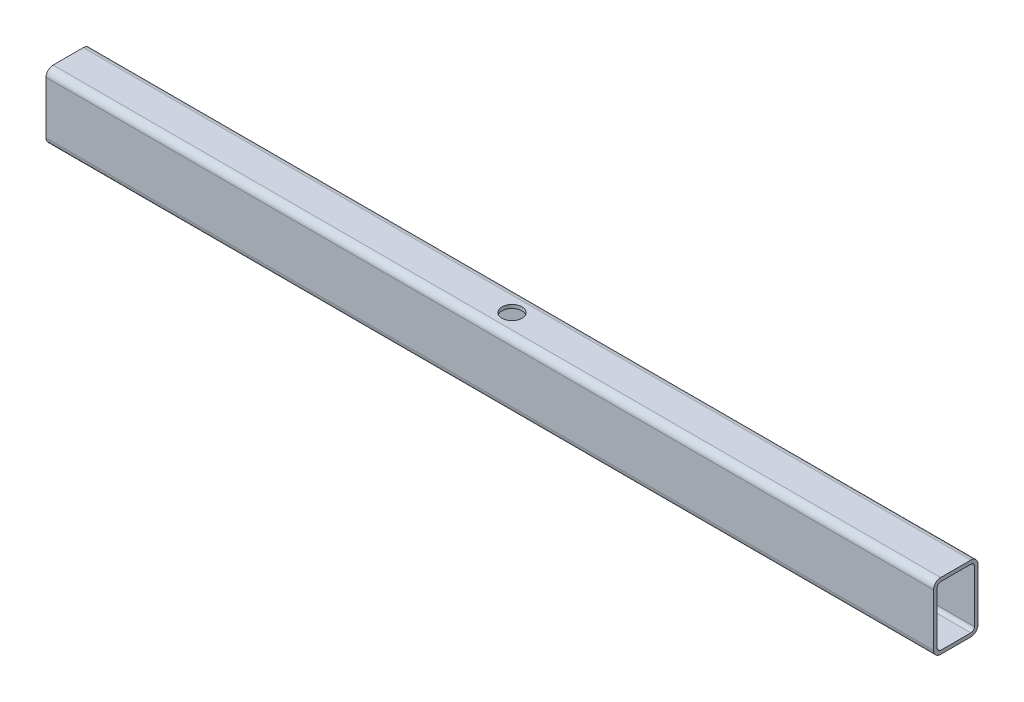
ISO-10303-21;
HEADER;
FILE_DESCRIPTION(('STEP AP214'),'2;1');
FILE_NAME('part.step','',(''),(''),'','','');
FILE_SCHEMA(('AUTOMOTIVE_DESIGN { 1 0 10303 214 1 1 1 1 }'));
ENDSEC;
DATA;
#1=APPLICATION_CONTEXT('core data for automotive mechanical design processes');
#2=APPLICATION_PROTOCOL_DEFINITION('international standard','automotive_design',2000,#1);
#3=PRODUCT_CONTEXT('',#1,'mechanical');
#4=PRODUCT('Part','Part','',(#3));
#5=PRODUCT_RELATED_PRODUCT_CATEGORY('part','',(#4));
#6=PRODUCT_DEFINITION_FORMATION('','',#4);
#7=PRODUCT_DEFINITION_CONTEXT('part definition',#1,'design');
#8=PRODUCT_DEFINITION('design','',#6,#7);
#9=PRODUCT_DEFINITION_SHAPE('','',#8);
#10=(LENGTH_UNIT() NAMED_UNIT(*) SI_UNIT(.MILLI.,.METRE.));
#11=(NAMED_UNIT(*) PLANE_ANGLE_UNIT() SI_UNIT($,.RADIAN.));
#12=(NAMED_UNIT(*) SI_UNIT($,.STERADIAN.) SOLID_ANGLE_UNIT());
#13=UNCERTAINTY_MEASURE_WITH_UNIT(LENGTH_MEASURE(1.E-05),#10,'distance_accuracy_value','');
#14=(GEOMETRIC_REPRESENTATION_CONTEXT(3) GLOBAL_UNCERTAINTY_ASSIGNED_CONTEXT((#13)) GLOBAL_UNIT_ASSIGNED_CONTEXT((#10,
#11,#12)) REPRESENTATION_CONTEXT('',''));
#15=CARTESIAN_POINT('',(0.,0.,0.));
#16=DIRECTION('',(0.,0.,1.));
#17=DIRECTION('',(1.,0.,0.));
#18=AXIS2_PLACEMENT_3D('',#15,#16,#17);
#19=CARTESIAN_POINT('',(200.,5.9,-3.4));
#20=DIRECTION('',(-1.,0.,0.));
#21=DIRECTION('',(0.,0.,1.));
#22=AXIS2_PLACEMENT_3D('',#19,#20,#21);
#23=CYLINDRICAL_SURFACE('',#22,1.6);
#24=CARTESIAN_POINT('',(0.,5.9,-3.4));
#25=DIRECTION('',(1.,0.,0.));
#26=DIRECTION('',(0.,0.,-1.));
#27=AXIS2_PLACEMENT_3D('',#24,#25,#26);
#28=CIRCLE('',#27,1.6);
#29=CARTESIAN_POINT('',(0.,5.9,-5.));
#30=VERTEX_POINT('',#29);
#31=CARTESIAN_POINT('',(0.,7.5,-3.4));
#32=VERTEX_POINT('',#31);
#33=EDGE_CURVE('E238',#30,#32,#28,.T.);
#34=ORIENTED_EDGE('',*,*,#33,.T.);
#35=DIRECTION('',(-1.,0.,0.));
#36=VECTOR('',#35,1.);
#37=CARTESIAN_POINT('',(200.,7.5,-3.4));
#38=LINE('',#37,#36);
#39=CARTESIAN_POINT('',(200.,7.5,-3.4));
#40=VERTEX_POINT('',#39);
#41=EDGE_CURVE('E12',#40,#32,#38,.T.);
#42=ORIENTED_EDGE('',*,*,#41,.F.);
#43=CARTESIAN_POINT('',(200.,5.9,-3.4));
#44=DIRECTION('',(1.,0.,0.));
#45=DIRECTION('',(0.,0.,-1.));
#46=AXIS2_PLACEMENT_3D('',#43,#44,#45);
#47=CIRCLE('',#46,1.6);
#48=CARTESIAN_POINT('',(200.,5.9,-5.));
#49=VERTEX_POINT('',#48);
#50=EDGE_CURVE('E317',#49,#40,#47,.T.);
#51=ORIENTED_EDGE('',*,*,#50,.F.);
#52=DIRECTION('',(-1.,0.,0.));
#53=VECTOR('',#52,1.);
#54=CARTESIAN_POINT('',(200.,5.9,-5.));
#55=LINE('',#54,#53);
#56=EDGE_CURVE('E253',#49,#30,#55,.T.);
#57=ORIENTED_EDGE('',*,*,#56,.T.);
#58=EDGE_LOOP('',(#34,#42,#51,#57));
#59=FACE_BOUND('',#58,.T.);
#60=ADVANCED_FACE('F64',(#59),#23,.T.);
#61=CARTESIAN_POINT('',(200.,7.5,-3.4));
#62=DIRECTION('',(0.,-1.,0.));
#63=DIRECTION('',(0.,0.,-1.));
#64=AXIS2_PLACEMENT_3D('',#61,#62,#63);
#65=PLANE('',#64);
#66=CARTESIAN_POINT('',(100.,7.5,0.));
#67=DIRECTION('',(0.,-1.,0.));
#68=DIRECTION('',(0.,0.,-1.));
#69=AXIS2_PLACEMENT_3D('',#66,#67,#68);
#70=CIRCLE('',#69,2.25);
#71=CARTESIAN_POINT('',(100.,7.5,-2.25));
#72=VERTEX_POINT('',#71);
#73=EDGE_CURVE('E217',#72,#72,#70,.T.);
#74=ORIENTED_EDGE('',*,*,#73,.T.);
#75=EDGE_LOOP('',(#74));
#76=FACE_BOUND('',#75,.T.);
#77=DIRECTION('',(0.,0.,1.));
#78=VECTOR('',#77,1.);
#79=CARTESIAN_POINT('',(0.,7.5,-3.4));
#80=LINE('',#79,#78);
#81=CARTESIAN_POINT('',(0.,7.5,3.4));
#82=VERTEX_POINT('',#81);
#83=EDGE_CURVE('E241',#32,#82,#80,.T.);
#84=ORIENTED_EDGE('',*,*,#83,.T.);
#85=DIRECTION('',(-1.,0.,0.));
#86=VECTOR('',#85,1.);
#87=CARTESIAN_POINT('',(200.,7.5,3.4));
#88=LINE('',#87,#86);
#89=CARTESIAN_POINT('',(200.,7.5,3.4));
#90=VERTEX_POINT('',#89);
#91=EDGE_CURVE('E74',#90,#82,#88,.T.);
#92=ORIENTED_EDGE('',*,*,#91,.F.);
#93=DIRECTION('',(0.,0.,1.));
#94=VECTOR('',#93,1.);
#95=CARTESIAN_POINT('',(200.,7.5,-3.4));
#96=LINE('',#95,#94);
#97=EDGE_CURVE('E319',#40,#90,#96,.T.);
#98=ORIENTED_EDGE('',*,*,#97,.F.);
#99=ORIENTED_EDGE('',*,*,#41,.T.);
#100=EDGE_LOOP('',(#84,#92,#98,#99));
#101=FACE_BOUND('',#100,.T.);
#102=ADVANCED_FACE('F354',(#76,#101),#65,.F.);
#103=CARTESIAN_POINT('',(200.,5.9,3.4));
#104=DIRECTION('',(-1.,0.,0.));
#105=DIRECTION('',(0.,0.,1.));
#106=AXIS2_PLACEMENT_3D('',#103,#104,#105);
#107=CYLINDRICAL_SURFACE('',#106,1.6);
#108=CARTESIAN_POINT('',(0.,5.9,3.4));
#109=DIRECTION('',(1.,0.,0.));
#110=DIRECTION('',(0.,0.,-1.));
#111=AXIS2_PLACEMENT_3D('',#108,#109,#110);
#112=CIRCLE('',#111,1.6);
#113=CARTESIAN_POINT('',(0.,5.9,5.));
#114=VERTEX_POINT('',#113);
#115=EDGE_CURVE('E243',#82,#114,#112,.T.);
#116=ORIENTED_EDGE('',*,*,#115,.T.);
#117=DIRECTION('',(-1.,0.,0.));
#118=VECTOR('',#117,1.);
#119=CARTESIAN_POINT('',(200.,5.9,5.));
#120=LINE('',#119,#118);
#121=CARTESIAN_POINT('',(200.,5.9,5.));
#122=VERTEX_POINT('',#121);
#123=EDGE_CURVE('E260',#122,#114,#120,.T.);
#124=ORIENTED_EDGE('',*,*,#123,.F.);
#125=CARTESIAN_POINT('',(200.,5.9,3.4));
#126=DIRECTION('',(1.,0.,0.));
#127=DIRECTION('',(0.,0.,-1.));
#128=AXIS2_PLACEMENT_3D('',#125,#126,#127);
#129=CIRCLE('',#128,1.6);
#130=EDGE_CURVE('E321',#90,#122,#129,.T.);
#131=ORIENTED_EDGE('',*,*,#130,.F.);
#132=ORIENTED_EDGE('',*,*,#91,.T.);
#133=EDGE_LOOP('',(#116,#124,#131,#132));
#134=FACE_BOUND('',#133,.T.);
#135=ADVANCED_FACE('F359',(#134),#107,.T.);
#136=CARTESIAN_POINT('',(200.,-5.9,5.));
#137=DIRECTION('',(0.,0.,-1.));
#138=DIRECTION('',(-1.,0.,0.));
#139=AXIS2_PLACEMENT_3D('',#136,#137,#138);
#140=PLANE('',#139);
#141=DIRECTION('',(0.,-1.,0.));
#142=VECTOR('',#141,1.);
#143=CARTESIAN_POINT('',(0.,-5.9,5.));
#144=LINE('',#143,#142);
#145=CARTESIAN_POINT('',(0.,-5.9,5.));
#146=VERTEX_POINT('',#145);
#147=EDGE_CURVE('E245',#114,#146,#144,.T.);
#148=ORIENTED_EDGE('',*,*,#147,.T.);
#149=DIRECTION('',(-1.,0.,0.));
#150=VECTOR('',#149,1.);
#151=CARTESIAN_POINT('',(200.,-5.9,5.));
#152=LINE('',#151,#150);
#153=CARTESIAN_POINT('',(200.,-5.9,5.));
#154=VERTEX_POINT('',#153);
#155=EDGE_CURVE('E257',#154,#146,#152,.T.);
#156=ORIENTED_EDGE('',*,*,#155,.F.);
#157=DIRECTION('',(0.,-1.,0.));
#158=VECTOR('',#157,1.);
#159=CARTESIAN_POINT('',(200.,-5.9,5.));
#160=LINE('',#159,#158);
#161=EDGE_CURVE('E323',#122,#154,#160,.T.);
#162=ORIENTED_EDGE('',*,*,#161,.F.);
#163=ORIENTED_EDGE('',*,*,#123,.T.);
#164=EDGE_LOOP('',(#148,#156,#162,#163));
#165=FACE_BOUND('',#164,.T.);
#166=ADVANCED_FACE('F329',(#165),#140,.F.);
#167=CARTESIAN_POINT('',(200.,-5.9,3.4));
#168=DIRECTION('',(-1.,0.,0.));
#169=DIRECTION('',(0.,0.,1.));
#170=AXIS2_PLACEMENT_3D('',#167,#168,#169);
#171=CYLINDRICAL_SURFACE('',#170,1.6);
#172=CARTESIAN_POINT('',(0.,-5.9,3.4));
#173=DIRECTION('',(1.,0.,0.));
#174=DIRECTION('',(0.,0.,-1.));
#175=AXIS2_PLACEMENT_3D('',#172,#173,#174);
#176=CIRCLE('',#175,1.6);
#177=CARTESIAN_POINT('',(0.,-7.5,3.4));
#178=VERTEX_POINT('',#177);
#179=EDGE_CURVE('E247',#146,#178,#176,.T.);
#180=ORIENTED_EDGE('',*,*,#179,.T.);
#181=DIRECTION('',(-1.,0.,0.));
#182=VECTOR('',#181,1.);
#183=CARTESIAN_POINT('',(200.,-7.5,3.4));
#184=LINE('',#183,#182);
#185=CARTESIAN_POINT('',(200.,-7.5,3.4));
#186=VERTEX_POINT('',#185);
#187=EDGE_CURVE('E204',#186,#178,#184,.T.);
#188=ORIENTED_EDGE('',*,*,#187,.F.);
#189=CARTESIAN_POINT('',(200.,-5.9,3.4));
#190=DIRECTION('',(1.,0.,0.));
#191=DIRECTION('',(0.,0.,-1.));
#192=AXIS2_PLACEMENT_3D('',#189,#190,#191);
#193=CIRCLE('',#192,1.6);
#194=EDGE_CURVE('E195',#154,#186,#193,.T.);
#195=ORIENTED_EDGE('',*,*,#194,.F.);
#196=ORIENTED_EDGE('',*,*,#155,.T.);
#197=EDGE_LOOP('',(#180,#188,#195,#196));
#198=FACE_BOUND('',#197,.T.);
#199=ADVANCED_FACE('F333',(#198),#171,.T.);
#200=CARTESIAN_POINT('',(200.,-7.5,3.4));
#201=DIRECTION('',(0.,1.,0.));
#202=DIRECTION('',(0.,0.,1.));
#203=AXIS2_PLACEMENT_3D('',#200,#201,#202);
#204=PLANE('',#203);
#205=CARTESIAN_POINT('',(100.,-7.5,0.));
#206=DIRECTION('',(0.,1.,0.));
#207=DIRECTION('',(0.,0.,1.));
#208=AXIS2_PLACEMENT_3D('',#205,#206,#207);
#209=CIRCLE('',#208,2.25);
#210=CARTESIAN_POINT('',(100.,-7.5,2.24999999999999));
#211=VERTEX_POINT('',#210);
#212=EDGE_CURVE('E389',#211,#211,#209,.T.);
#213=ORIENTED_EDGE('',*,*,#212,.T.);
#214=EDGE_LOOP('',(#213));
#215=FACE_BOUND('',#214,.T.);
#216=DIRECTION('',(0.,0.,-1.));
#217=VECTOR('',#216,1.);
#218=CARTESIAN_POINT('',(0.,-7.5,3.4));
#219=LINE('',#218,#217);
#220=CARTESIAN_POINT('',(0.,-7.5,-3.4));
#221=VERTEX_POINT('',#220);
#222=EDGE_CURVE('E203',#178,#221,#219,.T.);
#223=ORIENTED_EDGE('',*,*,#222,.T.);
#224=DIRECTION('',(-1.,0.,0.));
#225=VECTOR('',#224,1.);
#226=CARTESIAN_POINT('',(200.,-7.5,-3.4));
#227=LINE('',#226,#225);
#228=CARTESIAN_POINT('',(200.,-7.5,-3.4));
#229=VERTEX_POINT('',#228);
#230=EDGE_CURVE('E200',#229,#221,#227,.T.);
#231=ORIENTED_EDGE('',*,*,#230,.F.);
#232=DIRECTION('',(0.,0.,-1.));
#233=VECTOR('',#232,1.);
#234=CARTESIAN_POINT('',(200.,-7.5,3.4));
#235=LINE('',#234,#233);
#236=EDGE_CURVE('E189',#186,#229,#235,.T.);
#237=ORIENTED_EDGE('',*,*,#236,.F.);
#238=ORIENTED_EDGE('',*,*,#187,.T.);
#239=EDGE_LOOP('',(#223,#231,#237,#238));
#240=FACE_BOUND('',#239,.T.);
#241=ADVANCED_FACE('F201',(#215,#240),#204,.F.);
#242=CARTESIAN_POINT('',(200.,-5.9,-3.4));
#243=DIRECTION('',(-1.,0.,0.));
#244=DIRECTION('',(0.,0.,1.));
#245=AXIS2_PLACEMENT_3D('',#242,#243,#244);
#246=CYLINDRICAL_SURFACE('',#245,1.6);
#247=CARTESIAN_POINT('',(0.,-5.9,-3.4));
#248=DIRECTION('',(1.,0.,0.));
#249=DIRECTION('',(0.,0.,-1.));
#250=AXIS2_PLACEMENT_3D('',#247,#248,#249);
#251=CIRCLE('',#250,1.6);
#252=CARTESIAN_POINT('',(0.,-5.9,-5.));
#253=VERTEX_POINT('',#252);
#254=EDGE_CURVE('E136',#221,#253,#251,.T.);
#255=ORIENTED_EDGE('',*,*,#254,.T.);
#256=DIRECTION('',(-1.,0.,0.));
#257=VECTOR('',#256,1.);
#258=CARTESIAN_POINT('',(200.,-5.9,-5.));
#259=LINE('',#258,#257);
#260=CARTESIAN_POINT('',(200.,-5.9,-5.));
#261=VERTEX_POINT('',#260);
#262=EDGE_CURVE('E205',#261,#253,#259,.T.);
#263=ORIENTED_EDGE('',*,*,#262,.F.);
#264=CARTESIAN_POINT('',(200.,-5.9,-3.4));
#265=DIRECTION('',(1.,0.,0.));
#266=DIRECTION('',(0.,0.,-1.));
#267=AXIS2_PLACEMENT_3D('',#264,#265,#266);
#268=CIRCLE('',#267,1.6);
#269=EDGE_CURVE('E193',#229,#261,#268,.T.);
#270=ORIENTED_EDGE('',*,*,#269,.F.);
#271=ORIENTED_EDGE('',*,*,#230,.T.);
#272=EDGE_LOOP('',(#255,#263,#270,#271));
#273=FACE_BOUND('',#272,.T.);
#274=ADVANCED_FACE('F207',(#273),#246,.T.);
#275=CARTESIAN_POINT('',(200.,5.9,3.4));
#276=DIRECTION('',(-1.,0.,0.));
#277=DIRECTION('',(0.,0.,1.));
#278=AXIS2_PLACEMENT_3D('',#275,#276,#277);
#279=CYLINDRICAL_SURFACE('',#278,0.8);
#280=CARTESIAN_POINT('',(0.,5.9,3.4));
#281=DIRECTION('',(1.,0.,0.));
#282=DIRECTION('',(0.,0.,-1.));
#283=AXIS2_PLACEMENT_3D('',#280,#281,#282);
#284=CIRCLE('',#283,0.8);
#285=CARTESIAN_POINT('',(0.,6.7,3.4));
#286=VERTEX_POINT('',#285);
#287=CARTESIAN_POINT('',(0.,5.9,4.2));
#288=VERTEX_POINT('',#287);
#289=EDGE_CURVE('E213',#286,#288,#284,.T.);
#290=ORIENTED_EDGE('',*,*,#289,.F.);
#291=DIRECTION('',(-1.,0.,0.));
#292=VECTOR('',#291,1.);
#293=CARTESIAN_POINT('',(200.,6.7,3.4));
#294=LINE('',#293,#292);
#295=CARTESIAN_POINT('',(200.,6.7,3.4));
#296=VERTEX_POINT('',#295);
#297=EDGE_CURVE('E150',#296,#286,#294,.T.);
#298=ORIENTED_EDGE('',*,*,#297,.F.);
#299=CARTESIAN_POINT('',(200.,5.9,3.4));
#300=DIRECTION('',(1.,0.,0.));
#301=DIRECTION('',(0.,0.,-1.));
#302=AXIS2_PLACEMENT_3D('',#299,#300,#301);
#303=CIRCLE('',#302,0.8);
#304=CARTESIAN_POINT('',(200.,5.9,4.2));
#305=VERTEX_POINT('',#304);
#306=EDGE_CURVE('E252',#296,#305,#303,.T.);
#307=ORIENTED_EDGE('',*,*,#306,.T.);
#308=DIRECTION('',(-1.,0.,0.));
#309=VECTOR('',#308,1.);
#310=CARTESIAN_POINT('',(200.,5.9,4.2));
#311=LINE('',#310,#309);
#312=EDGE_CURVE('E209',#305,#288,#311,.T.);
#313=ORIENTED_EDGE('',*,*,#312,.T.);
#314=EDGE_LOOP('',(#290,#298,#307,#313));
#315=FACE_BOUND('',#314,.T.);
#316=ADVANCED_FACE('F66',(#315),#279,.F.);
#317=CARTESIAN_POINT('',(200.,6.7,-3.4));
#318=DIRECTION('',(0.,-1.,0.));
#319=DIRECTION('',(0.,0.,-1.));
#320=AXIS2_PLACEMENT_3D('',#317,#318,#319);
#321=PLANE('',#320);
#322=CARTESIAN_POINT('',(100.,6.7,0.));
#323=DIRECTION('',(0.,-1.,0.));
#324=DIRECTION('',(0.,0.,-1.));
#325=AXIS2_PLACEMENT_3D('',#322,#323,#324);
#326=CIRCLE('',#325,2.25);
#327=CARTESIAN_POINT('',(100.,6.7,-2.25));
#328=VERTEX_POINT('',#327);
#329=EDGE_CURVE('E387',#328,#328,#326,.T.);
#330=ORIENTED_EDGE('',*,*,#329,.F.);
#331=EDGE_LOOP('',(#330));
#332=FACE_BOUND('',#331,.T.);
#333=DIRECTION('',(0.,0.,1.));
#334=VECTOR('',#333,1.);
#335=CARTESIAN_POINT('',(0.,6.7,-3.4));
#336=LINE('',#335,#334);
#337=CARTESIAN_POINT('',(0.,6.7,-3.4));
#338=VERTEX_POINT('',#337);
#339=EDGE_CURVE('E216',#338,#286,#336,.T.);
#340=ORIENTED_EDGE('',*,*,#339,.F.);
#341=DIRECTION('',(-1.,0.,0.));
#342=VECTOR('',#341,1.);
#343=CARTESIAN_POINT('',(200.,6.7,-3.4));
#344=LINE('',#343,#342);
#345=CARTESIAN_POINT('',(200.,6.7,-3.4));
#346=VERTEX_POINT('',#345);
#347=EDGE_CURVE('E276',#346,#338,#344,.T.);
#348=ORIENTED_EDGE('',*,*,#347,.F.);
#349=DIRECTION('',(0.,0.,1.));
#350=VECTOR('',#349,1.);
#351=CARTESIAN_POINT('',(200.,6.7,-3.4));
#352=LINE('',#351,#350);
#353=EDGE_CURVE('E282',#346,#296,#352,.T.);
#354=ORIENTED_EDGE('',*,*,#353,.T.);
#355=ORIENTED_EDGE('',*,*,#297,.T.);
#356=EDGE_LOOP('',(#340,#348,#354,#355));
#357=FACE_BOUND('',#356,.T.);
#358=ADVANCED_FACE('F280',(#332,#357),#321,.T.);
#359=CARTESIAN_POINT('',(200.,5.9,-3.4));
#360=DIRECTION('',(-1.,0.,0.));
#361=DIRECTION('',(0.,0.,1.));
#362=AXIS2_PLACEMENT_3D('',#359,#360,#361);
#363=CYLINDRICAL_SURFACE('',#362,0.8);
#364=CARTESIAN_POINT('',(0.,5.9,-3.4));
#365=DIRECTION('',(1.,0.,0.));
#366=DIRECTION('',(0.,0.,-1.));
#367=AXIS2_PLACEMENT_3D('',#364,#365,#366);
#368=CIRCLE('',#367,0.8);
#369=CARTESIAN_POINT('',(0.,5.9,-4.2));
#370=VERTEX_POINT('',#369);
#371=EDGE_CURVE('E220',#370,#338,#368,.T.);
#372=ORIENTED_EDGE('',*,*,#371,.F.);
#373=DIRECTION('',(-1.,0.,0.));
#374=VECTOR('',#373,1.);
#375=CARTESIAN_POINT('',(200.,5.9,-4.2));
#376=LINE('',#375,#374);
#377=CARTESIAN_POINT('',(200.,5.9,-4.2));
#378=VERTEX_POINT('',#377);
#379=EDGE_CURVE('E274',#378,#370,#376,.T.);
#380=ORIENTED_EDGE('',*,*,#379,.F.);
#381=CARTESIAN_POINT('',(200.,5.9,-3.4));
#382=DIRECTION('',(1.,0.,0.));
#383=DIRECTION('',(0.,0.,-1.));
#384=AXIS2_PLACEMENT_3D('',#381,#382,#383);
#385=CIRCLE('',#384,0.8);
#386=EDGE_CURVE('E293',#378,#346,#385,.T.);
#387=ORIENTED_EDGE('',*,*,#386,.T.);
#388=ORIENTED_EDGE('',*,*,#347,.T.);
#389=EDGE_LOOP('',(#372,#380,#387,#388));
#390=FACE_BOUND('',#389,.T.);
#391=ADVANCED_FACE('F290',(#390),#363,.F.);
#392=CARTESIAN_POINT('',(200.,5.9,-4.2));
#393=DIRECTION('',(0.,0.,1.));
#394=DIRECTION('',(1.,0.,0.));
#395=AXIS2_PLACEMENT_3D('',#392,#393,#394);
#396=PLANE('',#395);
#397=DIRECTION('',(0.,1.,0.));
#398=VECTOR('',#397,1.);
#399=CARTESIAN_POINT('',(0.,5.9,-4.2));
#400=LINE('',#399,#398);
#401=CARTESIAN_POINT('',(0.,-5.9,-4.2));
#402=VERTEX_POINT('',#401);
#403=EDGE_CURVE('E223',#402,#370,#400,.T.);
#404=ORIENTED_EDGE('',*,*,#403,.F.);
#405=DIRECTION('',(-1.,0.,0.));
#406=VECTOR('',#405,1.);
#407=CARTESIAN_POINT('',(200.,-5.9,-4.2));
#408=LINE('',#407,#406);
#409=CARTESIAN_POINT('',(200.,-5.9,-4.2));
#410=VERTEX_POINT('',#409);
#411=EDGE_CURVE('E272',#410,#402,#408,.T.);
#412=ORIENTED_EDGE('',*,*,#411,.F.);
#413=DIRECTION('',(0.,1.,0.));
#414=VECTOR('',#413,1.);
#415=CARTESIAN_POINT('',(200.,5.9,-4.2));
#416=LINE('',#415,#414);
#417=EDGE_CURVE('E299',#410,#378,#416,.T.);
#418=ORIENTED_EDGE('',*,*,#417,.T.);
#419=ORIENTED_EDGE('',*,*,#379,.T.);
#420=EDGE_LOOP('',(#404,#412,#418,#419));
#421=FACE_BOUND('',#420,.T.);
#422=ADVANCED_FACE('F374',(#421),#396,.T.);
#423=CARTESIAN_POINT('',(200.,-5.9,-3.4));
#424=DIRECTION('',(-1.,0.,0.));
#425=DIRECTION('',(0.,0.,1.));
#426=AXIS2_PLACEMENT_3D('',#423,#424,#425);
#427=CYLINDRICAL_SURFACE('',#426,0.8);
#428=CARTESIAN_POINT('',(0.,-5.9,-3.4));
#429=DIRECTION('',(1.,0.,0.));
#430=DIRECTION('',(0.,0.,-1.));
#431=AXIS2_PLACEMENT_3D('',#428,#429,#430);
#432=CIRCLE('',#431,0.8);
#433=CARTESIAN_POINT('',(0.,-6.7,-3.4));
#434=VERTEX_POINT('',#433);
#435=EDGE_CURVE('E226',#434,#402,#432,.T.);
#436=ORIENTED_EDGE('',*,*,#435,.F.);
#437=DIRECTION('',(-1.,0.,0.));
#438=VECTOR('',#437,1.);
#439=CARTESIAN_POINT('',(200.,-6.7,-3.4));
#440=LINE('',#439,#438);
#441=CARTESIAN_POINT('',(200.,-6.7,-3.4));
#442=VERTEX_POINT('',#441);
#443=EDGE_CURVE('E270',#442,#434,#440,.T.);
#444=ORIENTED_EDGE('',*,*,#443,.F.);
#445=CARTESIAN_POINT('',(200.,-5.9,-3.4));
#446=DIRECTION('',(1.,0.,0.));
#447=DIRECTION('',(0.,0.,-1.));
#448=AXIS2_PLACEMENT_3D('',#445,#446,#447);
#449=CIRCLE('',#448,0.8);
#450=EDGE_CURVE('E305',#442,#410,#449,.T.);
#451=ORIENTED_EDGE('',*,*,#450,.T.);
#452=ORIENTED_EDGE('',*,*,#411,.T.);
#453=EDGE_LOOP('',(#436,#444,#451,#452));
#454=FACE_BOUND('',#453,.T.);
#455=ADVANCED_FACE('F370',(#454),#427,.F.);
#456=CARTESIAN_POINT('',(200.,-6.7,3.4));
#457=DIRECTION('',(0.,1.,0.));
#458=DIRECTION('',(0.,0.,1.));
#459=AXIS2_PLACEMENT_3D('',#456,#457,#458);
#460=PLANE('',#459);
#461=CARTESIAN_POINT('',(100.,-6.7,0.));
#462=DIRECTION('',(0.,1.,0.));
#463=DIRECTION('',(0.,0.,1.));
#464=AXIS2_PLACEMENT_3D('',#461,#462,#463);
#465=CIRCLE('',#464,2.25);
#466=CARTESIAN_POINT('',(100.,-6.7,2.24999999999999));
#467=VERTEX_POINT('',#466);
#468=EDGE_CURVE('E68',#467,#467,#465,.T.);
#469=ORIENTED_EDGE('',*,*,#468,.F.);
#470=EDGE_LOOP('',(#469));
#471=FACE_BOUND('',#470,.T.);
#472=DIRECTION('',(0.,0.,-1.));
#473=VECTOR('',#472,1.);
#474=CARTESIAN_POINT('',(0.,-6.7,3.4));
#475=LINE('',#474,#473);
#476=CARTESIAN_POINT('',(0.,-6.7,3.4));
#477=VERTEX_POINT('',#476);
#478=EDGE_CURVE('E229',#477,#434,#475,.T.);
#479=ORIENTED_EDGE('',*,*,#478,.F.);
#480=DIRECTION('',(-1.,0.,0.));
#481=VECTOR('',#480,1.);
#482=CARTESIAN_POINT('',(200.,-6.7,3.4));
#483=LINE('',#482,#481);
#484=CARTESIAN_POINT('',(200.,-6.7,3.4));
#485=VERTEX_POINT('',#484);
#486=EDGE_CURVE('E268',#485,#477,#483,.T.);
#487=ORIENTED_EDGE('',*,*,#486,.F.);
#488=DIRECTION('',(0.,0.,-1.));
#489=VECTOR('',#488,1.);
#490=CARTESIAN_POINT('',(200.,-6.7,3.4));
#491=LINE('',#490,#489);
#492=EDGE_CURVE('E308',#485,#442,#491,.T.);
#493=ORIENTED_EDGE('',*,*,#492,.T.);
#494=ORIENTED_EDGE('',*,*,#443,.T.);
#495=EDGE_LOOP('',(#479,#487,#493,#494));
#496=FACE_BOUND('',#495,.T.);
#497=ADVANCED_FACE('F366',(#471,#496),#460,.T.);
#498=CARTESIAN_POINT('',(200.,-5.9,3.4));
#499=DIRECTION('',(-1.,0.,0.));
#500=DIRECTION('',(0.,0.,1.));
#501=AXIS2_PLACEMENT_3D('',#498,#499,#500);
#502=CYLINDRICAL_SURFACE('',#501,0.8);
#503=CARTESIAN_POINT('',(0.,-5.9,3.4));
#504=DIRECTION('',(1.,0.,0.));
#505=DIRECTION('',(0.,0.,-1.));
#506=AXIS2_PLACEMENT_3D('',#503,#504,#505);
#507=CIRCLE('',#506,0.8);
#508=CARTESIAN_POINT('',(0.,-5.9,4.2));
#509=VERTEX_POINT('',#508);
#510=EDGE_CURVE('E232',#509,#477,#507,.T.);
#511=ORIENTED_EDGE('',*,*,#510,.F.);
#512=DIRECTION('',(-1.,0.,0.));
#513=VECTOR('',#512,1.);
#514=CARTESIAN_POINT('',(200.,-5.9,4.2));
#515=LINE('',#514,#513);
#516=CARTESIAN_POINT('',(200.,-5.9,4.2));
#517=VERTEX_POINT('',#516);
#518=EDGE_CURVE('E266',#517,#509,#515,.T.);
#519=ORIENTED_EDGE('',*,*,#518,.F.);
#520=CARTESIAN_POINT('',(200.,-5.9,3.4));
#521=DIRECTION('',(1.,0.,0.));
#522=DIRECTION('',(0.,0.,-1.));
#523=AXIS2_PLACEMENT_3D('',#520,#521,#522);
#524=CIRCLE('',#523,0.8);
#525=EDGE_CURVE('E311',#517,#485,#524,.T.);
#526=ORIENTED_EDGE('',*,*,#525,.T.);
#527=ORIENTED_EDGE('',*,*,#486,.T.);
#528=EDGE_LOOP('',(#511,#519,#526,#527));
#529=FACE_BOUND('',#528,.T.);
#530=ADVANCED_FACE('F348',(#529),#502,.F.);
#531=CARTESIAN_POINT('',(200.,-5.9,4.2));
#532=DIRECTION('',(0.,0.,-1.));
#533=DIRECTION('',(-1.,0.,0.));
#534=AXIS2_PLACEMENT_3D('',#531,#532,#533);
#535=PLANE('',#534);
#536=DIRECTION('',(0.,-1.,0.));
#537=VECTOR('',#536,1.);
#538=CARTESIAN_POINT('',(0.,-5.9,4.2));
#539=LINE('',#538,#537);
#540=EDGE_CURVE('E235',#288,#509,#539,.T.);
#541=ORIENTED_EDGE('',*,*,#540,.F.);
#542=ORIENTED_EDGE('',*,*,#312,.F.);
#543=DIRECTION('',(0.,-1.,0.));
#544=VECTOR('',#543,1.);
#545=CARTESIAN_POINT('',(200.,-5.9,4.2));
#546=LINE('',#545,#544);
#547=EDGE_CURVE('E314',#305,#517,#546,.T.);
#548=ORIENTED_EDGE('',*,*,#547,.T.);
#549=ORIENTED_EDGE('',*,*,#518,.T.);
#550=EDGE_LOOP('',(#541,#542,#548,#549));
#551=FACE_BOUND('',#550,.T.);
#552=ADVANCED_FACE('F341',(#551),#535,.T.);
#553=CARTESIAN_POINT('',(200.,5.9,-5.));
#554=DIRECTION('',(0.,0.,1.));
#555=DIRECTION('',(1.,0.,0.));
#556=AXIS2_PLACEMENT_3D('',#553,#554,#555);
#557=PLANE('',#556);
#558=DIRECTION('',(0.,1.,0.));
#559=VECTOR('',#558,1.);
#560=CARTESIAN_POINT('',(0.,5.9,-5.));
#561=LINE('',#560,#559);
#562=EDGE_CURVE('E142',#253,#30,#561,.T.);
#563=ORIENTED_EDGE('',*,*,#562,.T.);
#564=ORIENTED_EDGE('',*,*,#56,.F.);
#565=DIRECTION('',(0.,1.,0.));
#566=VECTOR('',#565,1.);
#567=CARTESIAN_POINT('',(200.,5.9,-5.));
#568=LINE('',#567,#566);
#569=EDGE_CURVE('E83',#261,#49,#568,.T.);
#570=ORIENTED_EDGE('',*,*,#569,.F.);
#571=ORIENTED_EDGE('',*,*,#262,.T.);
#572=EDGE_LOOP('',(#563,#564,#570,#571));
#573=FACE_BOUND('',#572,.T.);
#574=ADVANCED_FACE('F339',(#573),#557,.F.);
#575=CARTESIAN_POINT('',(200.,5.9,-3.4));
#576=DIRECTION('',(1.,0.,0.));
#577=DIRECTION('',(0.,0.,-1.));
#578=AXIS2_PLACEMENT_3D('',#575,#576,#577);
#579=PLANE('',#578);
#580=ORIENTED_EDGE('',*,*,#306,.F.);
#581=ORIENTED_EDGE('',*,*,#353,.F.);
#582=ORIENTED_EDGE('',*,*,#386,.F.);
#583=ORIENTED_EDGE('',*,*,#417,.F.);
#584=ORIENTED_EDGE('',*,*,#450,.F.);
#585=ORIENTED_EDGE('',*,*,#492,.F.);
#586=ORIENTED_EDGE('',*,*,#525,.F.);
#587=ORIENTED_EDGE('',*,*,#547,.F.);
#588=EDGE_LOOP('',(#580,#581,#582,#583,#584,#585,#586,#587));
#589=FACE_BOUND('',#588,.T.);
#590=ORIENTED_EDGE('',*,*,#50,.T.);
#591=ORIENTED_EDGE('',*,*,#97,.T.);
#592=ORIENTED_EDGE('',*,*,#130,.T.);
#593=ORIENTED_EDGE('',*,*,#161,.T.);
#594=ORIENTED_EDGE('',*,*,#194,.T.);
#595=ORIENTED_EDGE('',*,*,#236,.T.);
#596=ORIENTED_EDGE('',*,*,#269,.T.);
#597=ORIENTED_EDGE('',*,*,#569,.T.);
#598=EDGE_LOOP('',(#590,#591,#592,#593,#594,#595,#596,#597));
#599=FACE_BOUND('',#598,.T.);
#600=ADVANCED_FACE('F191',(#589,#599),#579,.T.);
#601=CARTESIAN_POINT('',(0.,5.9,-3.4));
#602=DIRECTION('',(1.,0.,0.));
#603=DIRECTION('',(0.,0.,-1.));
#604=AXIS2_PLACEMENT_3D('',#601,#602,#603);
#605=PLANE('',#604);
#606=ORIENTED_EDGE('',*,*,#289,.T.);
#607=ORIENTED_EDGE('',*,*,#540,.T.);
#608=ORIENTED_EDGE('',*,*,#510,.T.);
#609=ORIENTED_EDGE('',*,*,#478,.T.);
#610=ORIENTED_EDGE('',*,*,#435,.T.);
#611=ORIENTED_EDGE('',*,*,#403,.T.);
#612=ORIENTED_EDGE('',*,*,#371,.T.);
#613=ORIENTED_EDGE('',*,*,#339,.T.);
#614=EDGE_LOOP('',(#606,#607,#608,#609,#610,#611,#612,#613));
#615=FACE_BOUND('',#614,.T.);
#616=ORIENTED_EDGE('',*,*,#33,.F.);
#617=ORIENTED_EDGE('',*,*,#562,.F.);
#618=ORIENTED_EDGE('',*,*,#254,.F.);
#619=ORIENTED_EDGE('',*,*,#222,.F.);
#620=ORIENTED_EDGE('',*,*,#179,.F.);
#621=ORIENTED_EDGE('',*,*,#147,.F.);
#622=ORIENTED_EDGE('',*,*,#115,.F.);
#623=ORIENTED_EDGE('',*,*,#83,.F.);
#624=EDGE_LOOP('',(#616,#617,#618,#619,#620,#621,#622,#623));
#625=FACE_BOUND('',#624,.T.);
#626=ADVANCED_FACE('F285',(#615,#625),#605,.F.);
#627=CARTESIAN_POINT('',(100.,-12.5,0.));
#628=DIRECTION('',(0.,1.,0.));
#629=DIRECTION('',(0.,0.,1.));
#630=AXIS2_PLACEMENT_3D('',#627,#628,#629);
#631=CYLINDRICAL_SURFACE('',#630,2.25);
#632=ORIENTED_EDGE('',*,*,#468,.T.);
#633=EDGE_LOOP('',(#632));
#634=FACE_BOUND('',#633,.T.);
#635=ORIENTED_EDGE('',*,*,#212,.F.);
#636=EDGE_LOOP('',(#635));
#637=FACE_BOUND('',#636,.T.);
#638=ADVANCED_FACE('F400',(#634,#637),#631,.F.);
#639=ORIENTED_EDGE('',*,*,#329,.T.);
#640=EDGE_LOOP('',(#639));
#641=FACE_BOUND('',#640,.T.);
#642=ORIENTED_EDGE('',*,*,#73,.F.);
#643=EDGE_LOOP('',(#642));
#644=FACE_BOUND('',#643,.T.);
#645=ADVANCED_FACE('F398',(#641,#644),#631,.F.);
#646=CLOSED_SHELL('',(#60,#102,#135,#166,#199,#241,#274,#316,#358,#391,#422,#455,#497,#530,#552,
#574,#600,#626,#638,#645));
#647=MANIFOLD_SOLID_BREP('B2',#646);
#648=ADVANCED_BREP_SHAPE_REPRESENTATION('',(#18,#647),#14);
#649=SHAPE_DEFINITION_REPRESENTATION(#9,#648);
ENDSEC;
END-ISO-10303-21;
